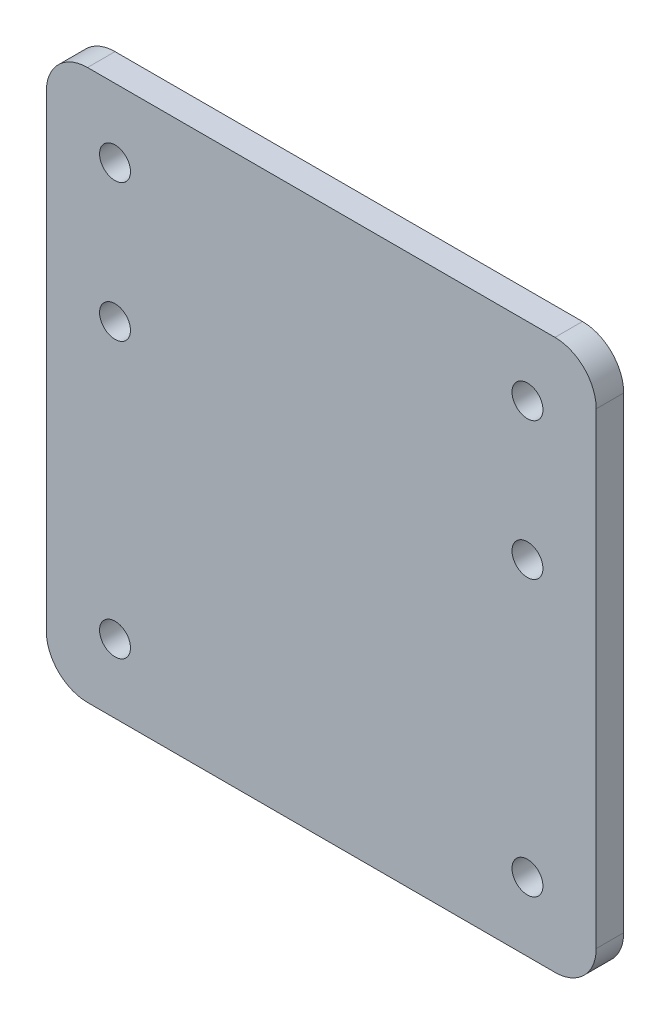
ISO-10303-21;
HEADER;
FILE_DESCRIPTION(('STEP AP214'),'2;1');
FILE_NAME('part.step','',(''),(''),'','','');
FILE_SCHEMA(('AUTOMOTIVE_DESIGN { 1 0 10303 214 1 1 1 1 }'));
ENDSEC;
DATA;
#1=APPLICATION_CONTEXT('core data for automotive mechanical design processes');
#2=APPLICATION_PROTOCOL_DEFINITION('international standard','automotive_design',2000,#1);
#3=PRODUCT_CONTEXT('',#1,'mechanical');
#4=PRODUCT('Part','Part','',(#3));
#5=PRODUCT_RELATED_PRODUCT_CATEGORY('part','',(#4));
#6=PRODUCT_DEFINITION_FORMATION('','',#4);
#7=PRODUCT_DEFINITION_CONTEXT('part definition',#1,'design');
#8=PRODUCT_DEFINITION('design','',#6,#7);
#9=PRODUCT_DEFINITION_SHAPE('','',#8);
#10=(LENGTH_UNIT() NAMED_UNIT(*) SI_UNIT(.MILLI.,.METRE.));
#11=(NAMED_UNIT(*) PLANE_ANGLE_UNIT() SI_UNIT($,.RADIAN.));
#12=(NAMED_UNIT(*) SI_UNIT($,.STERADIAN.) SOLID_ANGLE_UNIT());
#13=UNCERTAINTY_MEASURE_WITH_UNIT(LENGTH_MEASURE(1.E-05),#10,'distance_accuracy_value','');
#14=(GEOMETRIC_REPRESENTATION_CONTEXT(3) GLOBAL_UNCERTAINTY_ASSIGNED_CONTEXT((#13)) GLOBAL_UNIT_ASSIGNED_CONTEXT((#10,
#11,#12)) REPRESENTATION_CONTEXT('',''));
#15=CARTESIAN_POINT('',(0.,0.,0.));
#16=DIRECTION('',(0.,0.,1.));
#17=DIRECTION('',(1.,0.,0.));
#18=AXIS2_PLACEMENT_3D('',#15,#16,#17);
#19=CARTESIAN_POINT('',(-34.,-34.,4.));
#20=DIRECTION('',(0.,0.,1.));
#21=DIRECTION('',(1.,0.,0.));
#22=AXIS2_PLACEMENT_3D('',#19,#20,#21);
#23=PLANE('',#22);
#24=CARTESIAN_POINT('',(-30.,-30.,4.));
#25=DIRECTION('',(0.,0.,1.));
#26=DIRECTION('',(1.,0.,0.));
#27=AXIS2_PLACEMENT_3D('',#24,#25,#26);
#28=CIRCLE('',#27,2.25);
#29=CARTESIAN_POINT('',(-27.75,-30.,4.));
#30=VERTEX_POINT('',#29);
#31=EDGE_CURVE('E201',#30,#30,#28,.T.);
#32=ORIENTED_EDGE('',*,*,#31,.F.);
#33=EDGE_LOOP('',(#32));
#34=FACE_BOUND('',#33,.T.);
#35=CARTESIAN_POINT('',(30.,10.,4.));
#36=DIRECTION('',(0.,0.,1.));
#37=DIRECTION('',(1.,0.,0.));
#38=AXIS2_PLACEMENT_3D('',#35,#36,#37);
#39=CIRCLE('',#38,2.25);
#40=CARTESIAN_POINT('',(32.25,10.,4.));
#41=VERTEX_POINT('',#40);
#42=EDGE_CURVE('E189',#41,#41,#39,.T.);
#43=ORIENTED_EDGE('',*,*,#42,.F.);
#44=EDGE_LOOP('',(#43));
#45=FACE_BOUND('',#44,.T.);
#46=CARTESIAN_POINT('',(-30.,10.,4.));
#47=DIRECTION('',(0.,0.,1.));
#48=DIRECTION('',(1.,0.,0.));
#49=AXIS2_PLACEMENT_3D('',#46,#47,#48);
#50=CIRCLE('',#49,2.25);
#51=CARTESIAN_POINT('',(-27.75,10.,4.));
#52=VERTEX_POINT('',#51);
#53=EDGE_CURVE('E135',#52,#52,#50,.T.);
#54=ORIENTED_EDGE('',*,*,#53,.F.);
#55=EDGE_LOOP('',(#54));
#56=FACE_BOUND('',#55,.T.);
#57=CARTESIAN_POINT('',(-34.,-34.,4.));
#58=DIRECTION('',(0.,0.,1.));
#59=DIRECTION('',(1.,0.,0.));
#60=AXIS2_PLACEMENT_3D('',#57,#58,#59);
#61=CIRCLE('',#60,6.);
#62=CARTESIAN_POINT('',(-40.,-34.,4.));
#63=VERTEX_POINT('',#62);
#64=CARTESIAN_POINT('',(-34.,-40.,4.));
#65=VERTEX_POINT('',#64);
#66=EDGE_CURVE('E146',#63,#65,#61,.T.);
#67=ORIENTED_EDGE('',*,*,#66,.T.);
#68=DIRECTION('',(1.,0.,0.));
#69=VECTOR('',#68,1.);
#70=CARTESIAN_POINT('',(-34.,-40.,4.));
#71=LINE('',#70,#69);
#72=CARTESIAN_POINT('',(34.,-40.,4.));
#73=VERTEX_POINT('',#72);
#74=EDGE_CURVE('E94',#65,#73,#71,.T.);
#75=ORIENTED_EDGE('',*,*,#74,.T.);
#76=CARTESIAN_POINT('',(34.,-34.,4.));
#77=DIRECTION('',(0.,0.,1.));
#78=DIRECTION('',(1.,0.,0.));
#79=AXIS2_PLACEMENT_3D('',#76,#77,#78);
#80=CIRCLE('',#79,6.);
#81=CARTESIAN_POINT('',(40.,-34.,4.));
#82=VERTEX_POINT('',#81);
#83=EDGE_CURVE('E161',#73,#82,#80,.T.);
#84=ORIENTED_EDGE('',*,*,#83,.T.);
#85=DIRECTION('',(0.,1.,0.));
#86=VECTOR('',#85,1.);
#87=CARTESIAN_POINT('',(40.,-34.,4.));
#88=LINE('',#87,#86);
#89=CARTESIAN_POINT('',(40.,34.,4.));
#90=VERTEX_POINT('',#89);
#91=EDGE_CURVE('E174',#82,#90,#88,.T.);
#92=ORIENTED_EDGE('',*,*,#91,.T.);
#93=CARTESIAN_POINT('',(34.,34.,4.));
#94=DIRECTION('',(0.,0.,1.));
#95=DIRECTION('',(1.,0.,0.));
#96=AXIS2_PLACEMENT_3D('',#93,#94,#95);
#97=CIRCLE('',#96,6.);
#98=CARTESIAN_POINT('',(34.,40.,4.));
#99=VERTEX_POINT('',#98);
#100=EDGE_CURVE('E113',#90,#99,#97,.T.);
#101=ORIENTED_EDGE('',*,*,#100,.T.);
#102=DIRECTION('',(-1.,0.,0.));
#103=VECTOR('',#102,1.);
#104=CARTESIAN_POINT('',(34.,40.,4.));
#105=LINE('',#104,#103);
#106=CARTESIAN_POINT('',(-34.,40.,4.));
#107=VERTEX_POINT('',#106);
#108=EDGE_CURVE('E107',#99,#107,#105,.T.);
#109=ORIENTED_EDGE('',*,*,#108,.T.);
#110=CARTESIAN_POINT('',(-34.,34.,4.));
#111=DIRECTION('',(0.,0.,1.));
#112=DIRECTION('',(1.,0.,0.));
#113=AXIS2_PLACEMENT_3D('',#110,#111,#112);
#114=CIRCLE('',#113,6.);
#115=CARTESIAN_POINT('',(-40.,34.,4.));
#116=VERTEX_POINT('',#115);
#117=EDGE_CURVE('E111',#107,#116,#114,.T.);
#118=ORIENTED_EDGE('',*,*,#117,.T.);
#119=DIRECTION('',(0.,-1.,0.));
#120=VECTOR('',#119,1.);
#121=CARTESIAN_POINT('',(-40.,34.,4.));
#122=LINE('',#121,#120);
#123=EDGE_CURVE('E51',#116,#63,#122,.T.);
#124=ORIENTED_EDGE('',*,*,#123,.T.);
#125=EDGE_LOOP('',(#67,#75,#84,#92,#101,#109,#118,#124));
#126=FACE_BOUND('',#125,.T.);
#127=CARTESIAN_POINT('',(30.,-30.,4.));
#128=DIRECTION('',(0.,0.,1.));
#129=DIRECTION('',(1.,0.,0.));
#130=AXIS2_PLACEMENT_3D('',#127,#128,#129);
#131=CIRCLE('',#130,2.25);
#132=CARTESIAN_POINT('',(32.25,-30.,4.));
#133=VERTEX_POINT('',#132);
#134=EDGE_CURVE('E183',#133,#133,#131,.T.);
#135=ORIENTED_EDGE('',*,*,#134,.F.);
#136=EDGE_LOOP('',(#135));
#137=FACE_BOUND('',#136,.T.);
#138=CARTESIAN_POINT('',(-30.,30.,4.));
#139=DIRECTION('',(0.,0.,1.));
#140=DIRECTION('',(1.,0.,0.));
#141=AXIS2_PLACEMENT_3D('',#138,#139,#140);
#142=CIRCLE('',#141,2.25);
#143=CARTESIAN_POINT('',(-27.75,30.,4.));
#144=VERTEX_POINT('',#143);
#145=EDGE_CURVE('E195',#144,#144,#142,.T.);
#146=ORIENTED_EDGE('',*,*,#145,.F.);
#147=EDGE_LOOP('',(#146));
#148=FACE_BOUND('',#147,.T.);
#149=CARTESIAN_POINT('',(30.,30.,4.));
#150=DIRECTION('',(0.,0.,1.));
#151=DIRECTION('',(1.,0.,0.));
#152=AXIS2_PLACEMENT_3D('',#149,#150,#151);
#153=CIRCLE('',#152,2.25);
#154=CARTESIAN_POINT('',(32.25,30.,4.));
#155=VERTEX_POINT('',#154);
#156=EDGE_CURVE('E207',#155,#155,#153,.T.);
#157=ORIENTED_EDGE('',*,*,#156,.F.);
#158=EDGE_LOOP('',(#157));
#159=FACE_BOUND('',#158,.T.);
#160=ADVANCED_FACE('F34',(#34,#45,#56,#126,#137,#148,#159),#23,.T.);
#161=CARTESIAN_POINT('',(-34.,-34.,0.));
#162=DIRECTION('',(0.,0.,1.));
#163=DIRECTION('',(1.,0.,0.));
#164=AXIS2_PLACEMENT_3D('',#161,#162,#163);
#165=PLANE('',#164);
#166=CARTESIAN_POINT('',(-34.,-34.,0.));
#167=DIRECTION('',(0.,0.,1.));
#168=DIRECTION('',(1.,0.,0.));
#169=AXIS2_PLACEMENT_3D('',#166,#167,#168);
#170=CIRCLE('',#169,6.);
#171=CARTESIAN_POINT('',(-40.,-34.,0.));
#172=VERTEX_POINT('',#171);
#173=CARTESIAN_POINT('',(-34.,-40.,0.));
#174=VERTEX_POINT('',#173);
#175=EDGE_CURVE('E131',#172,#174,#170,.T.);
#176=ORIENTED_EDGE('',*,*,#175,.F.);
#177=DIRECTION('',(0.,-1.,0.));
#178=VECTOR('',#177,1.);
#179=CARTESIAN_POINT('',(-40.,34.,0.));
#180=LINE('',#179,#178);
#181=CARTESIAN_POINT('',(-40.,34.,0.));
#182=VERTEX_POINT('',#181);
#183=EDGE_CURVE('E86',#182,#172,#180,.T.);
#184=ORIENTED_EDGE('',*,*,#183,.F.);
#185=CARTESIAN_POINT('',(-34.,34.,0.));
#186=DIRECTION('',(0.,0.,1.));
#187=DIRECTION('',(1.,0.,0.));
#188=AXIS2_PLACEMENT_3D('',#185,#186,#187);
#189=CIRCLE('',#188,6.);
#190=CARTESIAN_POINT('',(-34.,40.,0.));
#191=VERTEX_POINT('',#190);
#192=EDGE_CURVE('E80',#191,#182,#189,.T.);
#193=ORIENTED_EDGE('',*,*,#192,.F.);
#194=DIRECTION('',(-1.,0.,0.));
#195=VECTOR('',#194,1.);
#196=CARTESIAN_POINT('',(34.,40.,0.));
#197=LINE('',#196,#195);
#198=CARTESIAN_POINT('',(34.,40.,0.));
#199=VERTEX_POINT('',#198);
#200=EDGE_CURVE('E121',#199,#191,#197,.T.);
#201=ORIENTED_EDGE('',*,*,#200,.F.);
#202=CARTESIAN_POINT('',(34.,34.,0.));
#203=DIRECTION('',(0.,0.,1.));
#204=DIRECTION('',(1.,0.,0.));
#205=AXIS2_PLACEMENT_3D('',#202,#203,#204);
#206=CIRCLE('',#205,6.);
#207=CARTESIAN_POINT('',(40.,34.,0.));
#208=VERTEX_POINT('',#207);
#209=EDGE_CURVE('E141',#208,#199,#206,.T.);
#210=ORIENTED_EDGE('',*,*,#209,.F.);
#211=DIRECTION('',(0.,1.,0.));
#212=VECTOR('',#211,1.);
#213=CARTESIAN_POINT('',(40.,-34.,0.));
#214=LINE('',#213,#212);
#215=CARTESIAN_POINT('',(40.,-34.,0.));
#216=VERTEX_POINT('',#215);
#217=EDGE_CURVE('E139',#216,#208,#214,.T.);
#218=ORIENTED_EDGE('',*,*,#217,.F.);
#219=CARTESIAN_POINT('',(34.,-34.,0.));
#220=DIRECTION('',(0.,0.,1.));
#221=DIRECTION('',(1.,0.,0.));
#222=AXIS2_PLACEMENT_3D('',#219,#220,#221);
#223=CIRCLE('',#222,6.);
#224=CARTESIAN_POINT('',(34.,-40.,0.));
#225=VERTEX_POINT('',#224);
#226=EDGE_CURVE('E137',#225,#216,#223,.T.);
#227=ORIENTED_EDGE('',*,*,#226,.F.);
#228=DIRECTION('',(1.,0.,0.));
#229=VECTOR('',#228,1.);
#230=CARTESIAN_POINT('',(-34.,-40.,0.));
#231=LINE('',#230,#229);
#232=EDGE_CURVE('E134',#174,#225,#231,.T.);
#233=ORIENTED_EDGE('',*,*,#232,.F.);
#234=EDGE_LOOP('',(#176,#184,#193,#201,#210,#218,#227,#233));
#235=FACE_BOUND('',#234,.T.);
#236=CARTESIAN_POINT('',(-30.,10.,0.));
#237=DIRECTION('',(0.,0.,1.));
#238=DIRECTION('',(1.,0.,0.));
#239=AXIS2_PLACEMENT_3D('',#236,#237,#238);
#240=CIRCLE('',#239,2.25);
#241=CARTESIAN_POINT('',(-27.75,10.,0.));
#242=VERTEX_POINT('',#241);
#243=EDGE_CURVE('E180',#242,#242,#240,.T.);
#244=ORIENTED_EDGE('',*,*,#243,.T.);
#245=EDGE_LOOP('',(#244));
#246=FACE_BOUND('',#245,.T.);
#247=CARTESIAN_POINT('',(30.,-30.,0.));
#248=DIRECTION('',(0.,0.,1.));
#249=DIRECTION('',(1.,0.,0.));
#250=AXIS2_PLACEMENT_3D('',#247,#248,#249);
#251=CIRCLE('',#250,2.25);
#252=CARTESIAN_POINT('',(32.25,-30.,0.));
#253=VERTEX_POINT('',#252);
#254=EDGE_CURVE('E186',#253,#253,#251,.T.);
#255=ORIENTED_EDGE('',*,*,#254,.T.);
#256=EDGE_LOOP('',(#255));
#257=FACE_BOUND('',#256,.T.);
#258=CARTESIAN_POINT('',(30.,10.,0.));
#259=DIRECTION('',(0.,0.,1.));
#260=DIRECTION('',(1.,0.,0.));
#261=AXIS2_PLACEMENT_3D('',#258,#259,#260);
#262=CIRCLE('',#261,2.25);
#263=CARTESIAN_POINT('',(32.25,10.,0.));
#264=VERTEX_POINT('',#263);
#265=EDGE_CURVE('E192',#264,#264,#262,.T.);
#266=ORIENTED_EDGE('',*,*,#265,.T.);
#267=EDGE_LOOP('',(#266));
#268=FACE_BOUND('',#267,.T.);
#269=CARTESIAN_POINT('',(-30.,30.,0.));
#270=DIRECTION('',(0.,0.,1.));
#271=DIRECTION('',(1.,0.,0.));
#272=AXIS2_PLACEMENT_3D('',#269,#270,#271);
#273=CIRCLE('',#272,2.25);
#274=CARTESIAN_POINT('',(-27.75,30.,0.));
#275=VERTEX_POINT('',#274);
#276=EDGE_CURVE('E198',#275,#275,#273,.T.);
#277=ORIENTED_EDGE('',*,*,#276,.T.);
#278=EDGE_LOOP('',(#277));
#279=FACE_BOUND('',#278,.T.);
#280=CARTESIAN_POINT('',(-30.,-30.,0.));
#281=DIRECTION('',(0.,0.,1.));
#282=DIRECTION('',(1.,0.,0.));
#283=AXIS2_PLACEMENT_3D('',#280,#281,#282);
#284=CIRCLE('',#283,2.25);
#285=CARTESIAN_POINT('',(-27.75,-30.,0.));
#286=VERTEX_POINT('',#285);
#287=EDGE_CURVE('E204',#286,#286,#284,.T.);
#288=ORIENTED_EDGE('',*,*,#287,.T.);
#289=EDGE_LOOP('',(#288));
#290=FACE_BOUND('',#289,.T.);
#291=CARTESIAN_POINT('',(30.,30.,0.));
#292=DIRECTION('',(0.,0.,1.));
#293=DIRECTION('',(1.,0.,0.));
#294=AXIS2_PLACEMENT_3D('',#291,#292,#293);
#295=CIRCLE('',#294,2.25);
#296=CARTESIAN_POINT('',(32.25,30.,0.));
#297=VERTEX_POINT('',#296);
#298=EDGE_CURVE('E210',#297,#297,#295,.T.);
#299=ORIENTED_EDGE('',*,*,#298,.T.);
#300=EDGE_LOOP('',(#299));
#301=FACE_BOUND('',#300,.T.);
#302=ADVANCED_FACE('F165',(#235,#246,#257,#268,#279,#290,#301),#165,.F.);
#303=CARTESIAN_POINT('',(-34.,-34.,4.));
#304=DIRECTION('',(0.,0.,-1.));
#305=DIRECTION('',(-1.,0.,0.));
#306=AXIS2_PLACEMENT_3D('',#303,#304,#305);
#307=CYLINDRICAL_SURFACE('',#306,6.);
#308=ORIENTED_EDGE('',*,*,#175,.T.);
#309=DIRECTION('',(0.,0.,-1.));
#310=VECTOR('',#309,1.);
#311=CARTESIAN_POINT('',(-34.,-40.,4.));
#312=LINE('',#311,#310);
#313=EDGE_CURVE('E11',#65,#174,#312,.T.);
#314=ORIENTED_EDGE('',*,*,#313,.F.);
#315=ORIENTED_EDGE('',*,*,#66,.F.);
#316=DIRECTION('',(0.,0.,-1.));
#317=VECTOR('',#316,1.);
#318=CARTESIAN_POINT('',(-40.,-34.,4.));
#319=LINE('',#318,#317);
#320=EDGE_CURVE('E127',#63,#172,#319,.T.);
#321=ORIENTED_EDGE('',*,*,#320,.T.);
#322=EDGE_LOOP('',(#308,#314,#315,#321));
#323=FACE_BOUND('',#322,.T.);
#324=ADVANCED_FACE('F36',(#323),#307,.T.);
#325=CARTESIAN_POINT('',(-34.,-40.,4.));
#326=DIRECTION('',(0.,1.,0.));
#327=DIRECTION('',(0.,0.,1.));
#328=AXIS2_PLACEMENT_3D('',#325,#326,#327);
#329=PLANE('',#328);
#330=ORIENTED_EDGE('',*,*,#232,.T.);
#331=DIRECTION('',(0.,0.,-1.));
#332=VECTOR('',#331,1.);
#333=CARTESIAN_POINT('',(34.,-40.,4.));
#334=LINE('',#333,#332);
#335=EDGE_CURVE('E43',#73,#225,#334,.T.);
#336=ORIENTED_EDGE('',*,*,#335,.F.);
#337=ORIENTED_EDGE('',*,*,#74,.F.);
#338=ORIENTED_EDGE('',*,*,#313,.T.);
#339=EDGE_LOOP('',(#330,#336,#337,#338));
#340=FACE_BOUND('',#339,.T.);
#341=ADVANCED_FACE('F244',(#340),#329,.F.);
#342=CARTESIAN_POINT('',(34.,-34.,4.));
#343=DIRECTION('',(0.,0.,-1.));
#344=DIRECTION('',(-1.,0.,0.));
#345=AXIS2_PLACEMENT_3D('',#342,#343,#344);
#346=CYLINDRICAL_SURFACE('',#345,6.);
#347=ORIENTED_EDGE('',*,*,#226,.T.);
#348=DIRECTION('',(0.,0.,-1.));
#349=VECTOR('',#348,1.);
#350=CARTESIAN_POINT('',(40.,-34.,4.));
#351=LINE('',#350,#349);
#352=EDGE_CURVE('E153',#82,#216,#351,.T.);
#353=ORIENTED_EDGE('',*,*,#352,.F.);
#354=ORIENTED_EDGE('',*,*,#83,.F.);
#355=ORIENTED_EDGE('',*,*,#335,.T.);
#356=EDGE_LOOP('',(#347,#353,#354,#355));
#357=FACE_BOUND('',#356,.T.);
#358=ADVANCED_FACE('F159',(#357),#346,.T.);
#359=CARTESIAN_POINT('',(40.,-34.,4.));
#360=DIRECTION('',(-1.,0.,0.));
#361=DIRECTION('',(0.,0.,1.));
#362=AXIS2_PLACEMENT_3D('',#359,#360,#361);
#363=PLANE('',#362);
#364=ORIENTED_EDGE('',*,*,#217,.T.);
#365=DIRECTION('',(0.,0.,-1.));
#366=VECTOR('',#365,1.);
#367=CARTESIAN_POINT('',(40.,34.,4.));
#368=LINE('',#367,#366);
#369=EDGE_CURVE('E150',#90,#208,#368,.T.);
#370=ORIENTED_EDGE('',*,*,#369,.F.);
#371=ORIENTED_EDGE('',*,*,#91,.F.);
#372=ORIENTED_EDGE('',*,*,#352,.T.);
#373=EDGE_LOOP('',(#364,#370,#371,#372));
#374=FACE_BOUND('',#373,.T.);
#375=ADVANCED_FACE('F170',(#374),#363,.F.);
#376=CARTESIAN_POINT('',(34.,34.,4.));
#377=DIRECTION('',(0.,0.,-1.));
#378=DIRECTION('',(-1.,0.,0.));
#379=AXIS2_PLACEMENT_3D('',#376,#377,#378);
#380=CYLINDRICAL_SURFACE('',#379,6.);
#381=ORIENTED_EDGE('',*,*,#209,.T.);
#382=DIRECTION('',(0.,0.,-1.));
#383=VECTOR('',#382,1.);
#384=CARTESIAN_POINT('',(34.,40.,4.));
#385=LINE('',#384,#383);
#386=EDGE_CURVE('E122',#99,#199,#385,.T.);
#387=ORIENTED_EDGE('',*,*,#386,.F.);
#388=ORIENTED_EDGE('',*,*,#100,.F.);
#389=ORIENTED_EDGE('',*,*,#369,.T.);
#390=EDGE_LOOP('',(#381,#387,#388,#389));
#391=FACE_BOUND('',#390,.T.);
#392=ADVANCED_FACE('F173',(#391),#380,.T.);
#393=CARTESIAN_POINT('',(34.,40.,4.));
#394=DIRECTION('',(0.,-1.,0.));
#395=DIRECTION('',(0.,0.,-1.));
#396=AXIS2_PLACEMENT_3D('',#393,#394,#395);
#397=PLANE('',#396);
#398=ORIENTED_EDGE('',*,*,#200,.T.);
#399=DIRECTION('',(0.,0.,-1.));
#400=VECTOR('',#399,1.);
#401=CARTESIAN_POINT('',(-34.,40.,4.));
#402=LINE('',#401,#400);
#403=EDGE_CURVE('E118',#107,#191,#402,.T.);
#404=ORIENTED_EDGE('',*,*,#403,.F.);
#405=ORIENTED_EDGE('',*,*,#108,.F.);
#406=ORIENTED_EDGE('',*,*,#386,.T.);
#407=EDGE_LOOP('',(#398,#404,#405,#406));
#408=FACE_BOUND('',#407,.T.);
#409=ADVANCED_FACE('F119',(#408),#397,.F.);
#410=CARTESIAN_POINT('',(-34.,34.,4.));
#411=DIRECTION('',(0.,0.,-1.));
#412=DIRECTION('',(-1.,0.,0.));
#413=AXIS2_PLACEMENT_3D('',#410,#411,#412);
#414=CYLINDRICAL_SURFACE('',#413,6.);
#415=ORIENTED_EDGE('',*,*,#192,.T.);
#416=DIRECTION('',(0.,0.,-1.));
#417=VECTOR('',#416,1.);
#418=CARTESIAN_POINT('',(-40.,34.,4.));
#419=LINE('',#418,#417);
#420=EDGE_CURVE('E123',#116,#182,#419,.T.);
#421=ORIENTED_EDGE('',*,*,#420,.F.);
#422=ORIENTED_EDGE('',*,*,#117,.F.);
#423=ORIENTED_EDGE('',*,*,#403,.T.);
#424=EDGE_LOOP('',(#415,#421,#422,#423));
#425=FACE_BOUND('',#424,.T.);
#426=ADVANCED_FACE('F125',(#425),#414,.T.);
#427=CARTESIAN_POINT('',(-40.,34.,4.));
#428=DIRECTION('',(1.,0.,0.));
#429=DIRECTION('',(0.,0.,-1.));
#430=AXIS2_PLACEMENT_3D('',#427,#428,#429);
#431=PLANE('',#430);
#432=ORIENTED_EDGE('',*,*,#183,.T.);
#433=ORIENTED_EDGE('',*,*,#320,.F.);
#434=ORIENTED_EDGE('',*,*,#123,.F.);
#435=ORIENTED_EDGE('',*,*,#420,.T.);
#436=EDGE_LOOP('',(#432,#433,#434,#435));
#437=FACE_BOUND('',#436,.T.);
#438=ADVANCED_FACE('F232',(#437),#431,.F.);
#439=CARTESIAN_POINT('',(-30.,10.,4.));
#440=DIRECTION('',(0.,0.,-1.));
#441=DIRECTION('',(-1.,0.,0.));
#442=AXIS2_PLACEMENT_3D('',#439,#440,#441);
#443=CYLINDRICAL_SURFACE('',#442,2.25);
#444=ORIENTED_EDGE('',*,*,#53,.T.);
#445=EDGE_LOOP('',(#444));
#446=FACE_BOUND('',#445,.T.);
#447=ORIENTED_EDGE('',*,*,#243,.F.);
#448=EDGE_LOOP('',(#447));
#449=FACE_BOUND('',#448,.T.);
#450=ADVANCED_FACE('F229',(#446,#449),#443,.F.);
#451=CARTESIAN_POINT('',(30.,-30.,4.));
#452=DIRECTION('',(0.,0.,-1.));
#453=DIRECTION('',(-1.,0.,0.));
#454=AXIS2_PLACEMENT_3D('',#451,#452,#453);
#455=CYLINDRICAL_SURFACE('',#454,2.25);
#456=ORIENTED_EDGE('',*,*,#134,.T.);
#457=EDGE_LOOP('',(#456));
#458=FACE_BOUND('',#457,.T.);
#459=ORIENTED_EDGE('',*,*,#254,.F.);
#460=EDGE_LOOP('',(#459));
#461=FACE_BOUND('',#460,.T.);
#462=ADVANCED_FACE('F310',(#458,#461),#455,.F.);
#463=CARTESIAN_POINT('',(30.,10.,4.));
#464=DIRECTION('',(0.,0.,-1.));
#465=DIRECTION('',(-1.,0.,0.));
#466=AXIS2_PLACEMENT_3D('',#463,#464,#465);
#467=CYLINDRICAL_SURFACE('',#466,2.25);
#468=ORIENTED_EDGE('',*,*,#42,.T.);
#469=EDGE_LOOP('',(#468));
#470=FACE_BOUND('',#469,.T.);
#471=ORIENTED_EDGE('',*,*,#265,.F.);
#472=EDGE_LOOP('',(#471));
#473=FACE_BOUND('',#472,.T.);
#474=ADVANCED_FACE('F318',(#470,#473),#467,.F.);
#475=CARTESIAN_POINT('',(-30.,30.,4.));
#476=DIRECTION('',(0.,0.,-1.));
#477=DIRECTION('',(-1.,0.,0.));
#478=AXIS2_PLACEMENT_3D('',#475,#476,#477);
#479=CYLINDRICAL_SURFACE('',#478,2.25);
#480=ORIENTED_EDGE('',*,*,#145,.T.);
#481=EDGE_LOOP('',(#480));
#482=FACE_BOUND('',#481,.T.);
#483=ORIENTED_EDGE('',*,*,#276,.F.);
#484=EDGE_LOOP('',(#483));
#485=FACE_BOUND('',#484,.T.);
#486=ADVANCED_FACE('F326',(#482,#485),#479,.F.);
#487=CARTESIAN_POINT('',(-30.,-30.,4.));
#488=DIRECTION('',(0.,0.,-1.));
#489=DIRECTION('',(-1.,0.,0.));
#490=AXIS2_PLACEMENT_3D('',#487,#488,#489);
#491=CYLINDRICAL_SURFACE('',#490,2.25);
#492=ORIENTED_EDGE('',*,*,#31,.T.);
#493=EDGE_LOOP('',(#492));
#494=FACE_BOUND('',#493,.T.);
#495=ORIENTED_EDGE('',*,*,#287,.F.);
#496=EDGE_LOOP('',(#495));
#497=FACE_BOUND('',#496,.T.);
#498=ADVANCED_FACE('F335',(#494,#497),#491,.F.);
#499=CARTESIAN_POINT('',(30.,30.,4.));
#500=DIRECTION('',(0.,0.,-1.));
#501=DIRECTION('',(-1.,0.,0.));
#502=AXIS2_PLACEMENT_3D('',#499,#500,#501);
#503=CYLINDRICAL_SURFACE('',#502,2.25);
#504=ORIENTED_EDGE('',*,*,#156,.T.);
#505=EDGE_LOOP('',(#504));
#506=FACE_BOUND('',#505,.T.);
#507=ORIENTED_EDGE('',*,*,#298,.F.);
#508=EDGE_LOOP('',(#507));
#509=FACE_BOUND('',#508,.T.);
#510=ADVANCED_FACE('F216',(#506,#509),#503,.F.);
#511=CLOSED_SHELL('',(#160,#302,#324,#341,#358,#375,#392,#409,#426,#438,#450,#462,#474,#486,
#498,#510));
#512=MANIFOLD_SOLID_BREP('B2',#511);
#513=ADVANCED_BREP_SHAPE_REPRESENTATION('',(#18,#512),#14);
#514=SHAPE_DEFINITION_REPRESENTATION(#9,#513);
ENDSEC;
END-ISO-10303-21;
